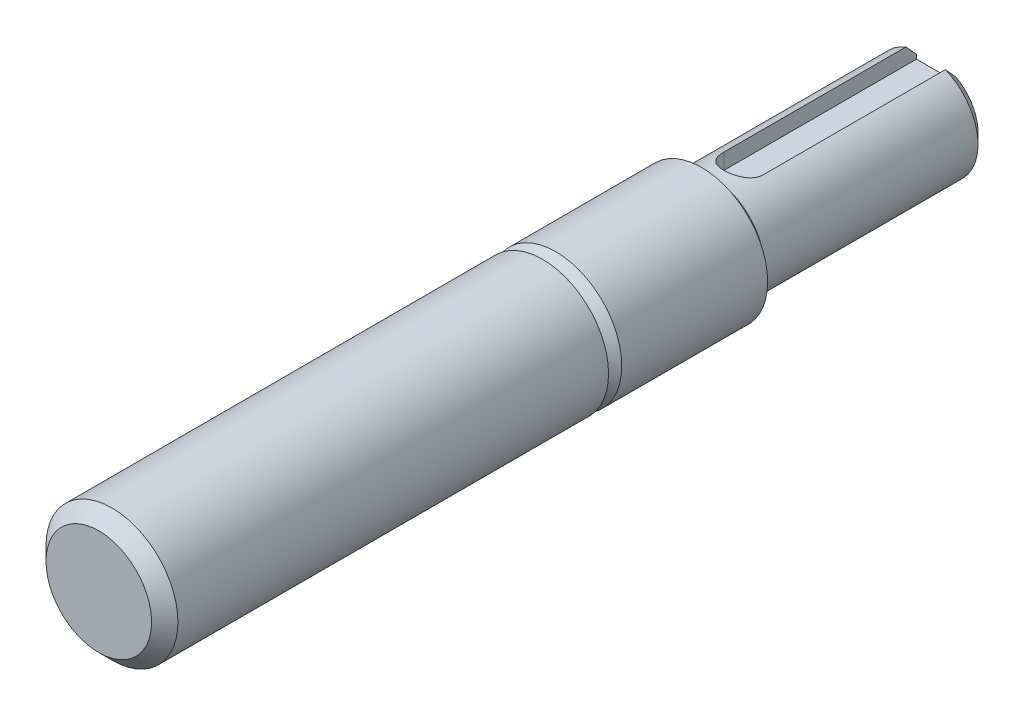
ISO-10303-21;
HEADER;
FILE_DESCRIPTION(('STEP AP214'),'2;1');
FILE_NAME('part.step','',(''),(''),'','','');
FILE_SCHEMA(('AUTOMOTIVE_DESIGN { 1 0 10303 214 1 1 1 1 }'));
ENDSEC;
DATA;
#1=APPLICATION_CONTEXT('core data for automotive mechanical design processes');
#2=APPLICATION_PROTOCOL_DEFINITION('international standard','automotive_design',2000,#1);
#3=PRODUCT_CONTEXT('',#1,'mechanical');
#4=PRODUCT('Part','Part','',(#3));
#5=PRODUCT_RELATED_PRODUCT_CATEGORY('part','',(#4));
#6=PRODUCT_DEFINITION_FORMATION('','',#4);
#7=PRODUCT_DEFINITION_CONTEXT('part definition',#1,'design');
#8=PRODUCT_DEFINITION('design','',#6,#7);
#9=PRODUCT_DEFINITION_SHAPE('','',#8);
#10=(LENGTH_UNIT() NAMED_UNIT(*) SI_UNIT(.MILLI.,.METRE.));
#11=(NAMED_UNIT(*) PLANE_ANGLE_UNIT() SI_UNIT($,.RADIAN.));
#12=(NAMED_UNIT(*) SI_UNIT($,.STERADIAN.) SOLID_ANGLE_UNIT());
#13=UNCERTAINTY_MEASURE_WITH_UNIT(LENGTH_MEASURE(1.E-05),#10,'distance_accuracy_value','');
#14=(GEOMETRIC_REPRESENTATION_CONTEXT(3) GLOBAL_UNCERTAINTY_ASSIGNED_CONTEXT((#13)) GLOBAL_UNIT_ASSIGNED_CONTEXT((#10,
#11,#12)) REPRESENTATION_CONTEXT('',''));
#15=CARTESIAN_POINT('',(0.,0.,0.));
#16=DIRECTION('',(0.,0.,1.));
#17=DIRECTION('',(1.,0.,0.));
#18=AXIS2_PLACEMENT_3D('',#15,#16,#17);
#19=CARTESIAN_POINT('',(0.,1.9812,-39.116));
#20=DIRECTION('',(0.,1.,0.));
#21=DIRECTION('',(0.,0.,1.));
#22=AXIS2_PLACEMENT_3D('',#19,#20,#21);
#23=PLANE('',#22);
#24=CARTESIAN_POINT('',(0.,1.9812,-39.116));
#25=DIRECTION('',(0.,1.,0.));
#26=DIRECTION('',(0.,0.,1.));
#27=AXIS2_PLACEMENT_3D('',#24,#25,#26);
#28=CIRCLE('',#27,1.19380000000001);
#29=CARTESIAN_POINT('',(-1.19380000000001,1.9812,-39.116));
#30=VERTEX_POINT('',#29);
#31=CARTESIAN_POINT('',(1.19380000000001,1.9812,-39.116));
#32=VERTEX_POINT('',#31);
#33=EDGE_CURVE('E74',#30,#32,#28,.T.);
#34=ORIENTED_EDGE('',*,*,#33,.T.);
#35=DIRECTION('',(0.,0.,-1.));
#36=VECTOR('',#35,1.);
#37=CARTESIAN_POINT('',(1.19380000000001,1.9812,-39.116));
#38=LINE('',#37,#36);
#39=CARTESIAN_POINT('',(1.19380000000001,1.9812,-50.8));
#40=VERTEX_POINT('',#39);
#41=EDGE_CURVE('E70',#32,#40,#38,.T.);
#42=ORIENTED_EDGE('',*,*,#41,.T.);
#43=DIRECTION('',(1.,0.,0.));
#44=VECTOR('',#43,1.);
#45=CARTESIAN_POINT('',(0.,1.9812,-50.8));
#46=LINE('',#45,#44);
#47=CARTESIAN_POINT('',(-1.19380000000001,1.9812,-50.8));
#48=VERTEX_POINT('',#47);
#49=EDGE_CURVE('E72',#40,#48,#46,.F.);
#50=ORIENTED_EDGE('',*,*,#49,.T.);
#51=DIRECTION('',(0.,0.,1.));
#52=VECTOR('',#51,1.);
#53=CARTESIAN_POINT('',(-1.19380000000001,1.9812,-50.8));
#54=LINE('',#53,#52);
#55=EDGE_CURVE('E97',#48,#30,#54,.T.);
#56=ORIENTED_EDGE('',*,*,#55,.T.);
#57=EDGE_LOOP('',(#34,#42,#50,#56));
#58=FACE_BOUND('',#57,.T.);
#59=ADVANCED_FACE('F16',(#58),#23,.T.);
#60=CARTESIAN_POINT('',(0.,2.54,-50.8));
#61=DIRECTION('',(0.,0.,1.));
#62=DIRECTION('',(1.,0.,0.));
#63=AXIS2_PLACEMENT_3D('',#60,#61,#62);
#64=PLANE('',#63);
#65=DIRECTION('',(0.,1.,0.));
#66=VECTOR('',#65,1.);
#67=CARTESIAN_POINT('',(1.19380000000001,1.9812,-50.8));
#68=LINE('',#67,#66);
#69=CARTESIAN_POINT('',(1.19380000000001,2.24197269385799,-50.7999999999905));
#70=VERTEX_POINT('',#69);
#71=EDGE_CURVE('E79',#40,#70,#68,.T.);
#72=ORIENTED_EDGE('',*,*,#71,.T.);
#73=CARTESIAN_POINT('',(0.,0.,-50.7999999999811));
#74=DIRECTION('',(0.,0.,1.));
#75=DIRECTION('',(0.,-1.,0.));
#76=AXIS2_PLACEMENT_3D('',#73,#74,#75);
#77=CIRCLE('',#76,2.54000000001042);
#78=CARTESIAN_POINT('',(-1.19380000000001,2.24197269386215,-50.7999999999869));
#79=VERTEX_POINT('',#78);
#80=EDGE_CURVE('E64',#79,#70,#77,.T.);
#81=ORIENTED_EDGE('',*,*,#80,.F.);
#82=DIRECTION('',(0.,1.,0.));
#83=VECTOR('',#82,1.);
#84=CARTESIAN_POINT('',(-1.19380000000001,1.9812,-50.8));
#85=LINE('',#84,#83);
#86=EDGE_CURVE('E85',#79,#48,#85,.F.);
#87=ORIENTED_EDGE('',*,*,#86,.T.);
#88=ORIENTED_EDGE('',*,*,#49,.F.);
#89=EDGE_LOOP('',(#72,#81,#87,#88));
#90=FACE_BOUND('',#89,.T.);
#91=ADVANCED_FACE('F82',(#90),#64,.F.);
#92=CARTESIAN_POINT('',(1.19380000000001,1.9812,-39.116));
#93=DIRECTION('',(1.,0.,0.));
#94=DIRECTION('',(0.,0.,-1.));
#95=AXIS2_PLACEMENT_3D('',#92,#93,#94);
#96=PLANE('',#95);
#97=ORIENTED_EDGE('',*,*,#71,.F.);
#98=ORIENTED_EDGE('',*,*,#41,.F.);
#99=DIRECTION('',(0.,1.,0.));
#100=VECTOR('',#99,1.);
#101=CARTESIAN_POINT('',(1.19380000000001,1.9812,-39.116));
#102=LINE('',#101,#100);
#103=CARTESIAN_POINT('',(1.1938,2.94201743026788,-39.116));
#104=VERTEX_POINT('',#103);
#105=EDGE_CURVE('E91',#32,#104,#102,.T.);
#106=ORIENTED_EDGE('',*,*,#105,.T.);
#107=DIRECTION('',(0.,0.,1.));
#108=VECTOR('',#107,1.);
#109=CARTESIAN_POINT('',(1.19379999999999,2.94201743026788,0.));
#110=LINE('',#109,#108);
#111=CARTESIAN_POINT('',(1.1938,2.94201743026577,-50.1649999999977));
#112=VERTEX_POINT('',#111);
#113=EDGE_CURVE('E130',#112,#104,#110,.T.);
#114=ORIENTED_EDGE('',*,*,#113,.F.);
#115=CARTESIAN_POINT('',(1.19380000000001,2.24197269385559,-50.7999999999927));
#116=CARTESIAN_POINT('',(1.19380000000001,2.30102184773771,-50.7478727474391));
#117=CARTESIAN_POINT('',(1.19380000000001,2.35985132104959,-50.69549787316));
#118=CARTESIAN_POINT('',(1.19380000000001,2.47713422347973,-50.5903327827947));
#119=CARTESIAN_POINT('',(1.19380000000001,2.53558766595209,-50.5375425816077));
#120=CARTESIAN_POINT('',(1.19380000000001,2.65218538347845,-50.4316235937607));
#121=CARTESIAN_POINT('',(1.19380000000001,2.71032966196324,-50.3784948108723));
#122=CARTESIAN_POINT('',(1.19380000000001,2.82635784116005,-50.2719494622469));
#123=CARTESIAN_POINT('',(1.19380000000001,2.88424173252965,-50.2185328863328));
#124=CARTESIAN_POINT('',(1.19380000000001,2.94201743026367,-50.1649999999954));
#125=B_SPLINE_CURVE_WITH_KNOTS('',3,(#115,#116,#117,#118,#119,#120,#121,#122,#123,#124),
.UNSPECIFIED.,.F.,.F.,(4,2,2,2,4),(0.,0.236295571088805,0.472582703695561,0.708867208729262,
0.945160124852192),.UNSPECIFIED.);
#126=EDGE_CURVE('E19',#70,#112,#125,.T.);
#127=ORIENTED_EDGE('',*,*,#126,.F.);
#128=EDGE_LOOP('',(#97,#98,#106,#114,#127));
#129=FACE_BOUND('',#128,.T.);
#130=ADVANCED_FACE('F88',(#129),#96,.F.);
#131=CARTESIAN_POINT('',(0.,1.9812,-39.116));
#132=DIRECTION('',(0.,1.,0.));
#133=DIRECTION('',(0.,0.,1.));
#134=AXIS2_PLACEMENT_3D('',#131,#132,#133);
#135=CYLINDRICAL_SURFACE('',#134,1.19380000000001);
#136=ORIENTED_EDGE('',*,*,#33,.F.);
#137=DIRECTION('',(0.,1.,0.));
#138=VECTOR('',#137,1.);
#139=CARTESIAN_POINT('',(-1.19380000000001,1.9812,-39.116));
#140=LINE('',#139,#138);
#141=CARTESIAN_POINT('',(-1.19380000000001,2.94201743026787,-39.116));
#142=VERTEX_POINT('',#141);
#143=EDGE_CURVE('E39',#30,#142,#140,.T.);
#144=ORIENTED_EDGE('',*,*,#143,.T.);
#145=CARTESIAN_POINT('',(1.19380000000001,2.94201743026787,-39.116));
#146=CARTESIAN_POINT('',(1.19380119866681,2.94201358886016,-39.0837006794339));
#147=CARTESIAN_POINT('',(1.19248832274411,2.94255000472484,-39.0514181860547));
#148=CARTESIAN_POINT('',(1.18726004777156,2.94466476095056,-38.9871097153263));
#149=CARTESIAN_POINT('',(1.18334552701422,2.94624274968451,-38.955083655099));
#150=CARTESIAN_POINT('',(1.16778270495955,2.95246335059753,-38.8599733658816));
#151=CARTESIAN_POINT('',(1.15231460697322,2.95859328345991,-38.7975669873183));
#152=CARTESIAN_POINT('',(1.11178752058578,2.97405718396478,-38.6764915213747));
#153=CARTESIAN_POINT('',(1.08673654710446,2.98338847338763,-38.6178193584763));
#154=CARTESIAN_POINT('',(1.02781996154741,3.00419457553498,-38.5054495950299));
#155=CARTESIAN_POINT('',(0.993947310826063,3.01567109782596,-38.4517560133961));
#156=CARTESIAN_POINT('',(0.916556207241775,3.04010954434601,-38.3482459870198));
#157=CARTESIAN_POINT('',(0.872671556205366,3.05311512160913,-38.2987137068106));
#158=CARTESIAN_POINT('',(0.777268767976151,3.07878482333539,-38.2075022142624));
#159=CARTESIAN_POINT('',(0.725747937264901,3.09144882544369,-38.1658257847587));
#160=CARTESIAN_POINT('',(0.6143515026055,3.11553409970194,-38.0901245060353));
#161=CARTESIAN_POINT('',(0.554248365904535,3.12689715223569,-38.0564145947422));
#162=CARTESIAN_POINT('',(0.428755311996273,3.14655515237975,-37.9997321113863));
#163=CARTESIAN_POINT('',(0.363372090039045,3.15485391337642,-37.9767461843048));
#164=CARTESIAN_POINT('',(0.248113919559845,3.16566292006336,-37.9472046793581));
#165=CARTESIAN_POINT('',(0.199029981495505,3.1691437195283,-37.9378494767225));
#166=CARTESIAN_POINT('',(0.0999697368556447,3.17381293873971,-37.9253464096887));
#167=CARTESIAN_POINT('',(0.0499935098316278,3.175001561824,-37.9221979946888));
#168=CARTESIAN_POINT('',(-0.0645836126415482,3.17499798237338,-37.9222025905412));
#169=CARTESIAN_POINT('',(-0.129196067703951,3.17300972415623,-37.9274627613588));
#170=CARTESIAN_POINT('',(-0.256527554722542,3.16526427616921,-37.9483006085164));
#171=CARTESIAN_POINT('',(-0.319245052887508,3.15950411459594,-37.9638864203256));
#172=CARTESIAN_POINT('',(-0.440872116174805,3.14483739738043,-38.0047409480993));
#173=CARTESIAN_POINT('',(-0.49979020110212,3.135938193104,-38.0299870521123));
#174=CARTESIAN_POINT('',(-0.612540299690452,3.11587921133503,-38.0893476602135));
#175=CARTESIAN_POINT('',(-0.666371662363197,3.10471914507505,-38.1234632973162));
#176=CARTESIAN_POINT('',(-0.769730700845348,3.08075692073994,-38.2011170498578));
#177=CARTESIAN_POINT('',(-0.819012913250933,3.06790808599841,-38.2449673466599));
#178=CARTESIAN_POINT('',(-0.909725244508853,3.04224448099814,-38.3401877476378));
#179=CARTESIAN_POINT('',(-0.951152407159723,3.02942972534667,-38.3915606700694));
#180=CARTESIAN_POINT('',(-1.02655136130083,3.00473884965422,-38.5027816716127));
#181=CARTESIAN_POINT('',(-1.06017236896745,2.99291828643937,-38.5628808896544));
#182=CARTESIAN_POINT('',(-1.11669659174165,2.97229264990151,-38.6883666895999));
#183=CARTESIAN_POINT('',(-1.13961269630879,2.96348395352317,-38.7537468010455));
#184=CARTESIAN_POINT('',(-1.16897915366354,2.95199794769408,-38.8688091509099));
#185=CARTESIAN_POINT('',(-1.17825632196959,2.9482901704303,-38.9176833288506));
#186=CARTESIAN_POINT('',(-1.19067896582103,2.94328394485073,-39.0163579822044));
#187=CARTESIAN_POINT('',(-1.19382013270198,2.9419871895713,-39.0661590837433));
#188=CARTESIAN_POINT('',(-1.19380000000001,2.94201743026787,-39.116));
#189=B_SPLINE_CURVE_WITH_KNOTS('',3,(#145,#146,#147,#148,#149,#150,#151,#152,#153,#154,#155,
#156,#157,#158,#159,#160,#161,#162,#163,#164,#165,#166,#167,#168,#169,#170,#171,#172,#173,#174,
#175,#176,#177,#178,#179,#180,#181,#182,#183,#184,#185,#186,#187,#188),.UNSPECIFIED.,.F.,.F.,(4,
2,2,2,2,2,2,2,2,2,2,2,2,2,2,2,2,2,2,2,2,4),(0.,0.0968341725826232,0.193635671390047,
0.386380325113608,0.57896412240193,0.771702051855779,0.973134503540126,1.17463817656653,
1.383119611818,1.59134071893434,1.74118814916205,1.89102228588731,2.08458400778532,
2.2782984166848,2.47156214275157,2.66485056890994,2.86558014013226,3.06638510544821,
3.27496528909712,3.48329367597682,3.63252530028045,3.7818616765455),.UNSPECIFIED.);
#190=EDGE_CURVE('E121',#104,#142,#189,.T.);
#191=ORIENTED_EDGE('',*,*,#190,.F.);
#192=ORIENTED_EDGE('',*,*,#105,.F.);
#193=EDGE_LOOP('',(#136,#144,#191,#192));
#194=FACE_BOUND('',#193,.T.);
#195=ADVANCED_FACE('F132',(#194),#135,.F.);
#196=CARTESIAN_POINT('',(-1.19380000000001,1.9812,-50.8));
#197=DIRECTION('',(-1.,0.,0.));
#198=DIRECTION('',(0.,0.,1.));
#199=AXIS2_PLACEMENT_3D('',#196,#197,#198);
#200=PLANE('',#199);
#201=ORIENTED_EDGE('',*,*,#55,.F.);
#202=ORIENTED_EDGE('',*,*,#86,.F.);
#203=CARTESIAN_POINT('',(-1.19380000000001,2.94201743026367,-50.1649999999954));
#204=CARTESIAN_POINT('',(-1.19380000000001,2.88424173252965,-50.2185328863328));
#205=CARTESIAN_POINT('',(-1.19380000000001,2.82635784116006,-50.2719494622469));
#206=CARTESIAN_POINT('',(-1.19380000000001,2.71032966196325,-50.3784948108723));
#207=CARTESIAN_POINT('',(-1.19380000000001,2.65218538347846,-50.4316235937607));
#208=CARTESIAN_POINT('',(-1.19380000000001,2.5355876659521,-50.5375425816077));
#209=CARTESIAN_POINT('',(-1.19380000000001,2.47713422347974,-50.5903327827947));
#210=CARTESIAN_POINT('',(-1.19380000000001,2.3598513210496,-50.69549787316));
#211=CARTESIAN_POINT('',(-1.19380000000001,2.30102184773772,-50.7478727474391));
#212=CARTESIAN_POINT('',(-1.19380000000001,2.24197269385561,-50.7999999999927));
#213=B_SPLINE_CURVE_WITH_KNOTS('',3,(#203,#204,#205,#206,#207,#208,#209,#210,#211,#212),
.UNSPECIFIED.,.F.,.F.,(4,2,2,2,4),(0.,0.236292916122926,0.472577421156633,0.708864553763386,
0.945160124852199),.UNSPECIFIED.);
#214=CARTESIAN_POINT('',(-1.19380000000001,2.94201743026577,-50.1649999999977));
#215=VERTEX_POINT('',#214);
#216=EDGE_CURVE('E148',#215,#79,#213,.T.);
#217=ORIENTED_EDGE('',*,*,#216,.F.);
#218=DIRECTION('',(0.,0.,1.));
#219=VECTOR('',#218,1.);
#220=CARTESIAN_POINT('',(-1.19380000000001,2.94201743026787,0.));
#221=LINE('',#220,#219);
#222=EDGE_CURVE('E129',#142,#215,#221,.F.);
#223=ORIENTED_EDGE('',*,*,#222,.F.);
#224=ORIENTED_EDGE('',*,*,#143,.F.);
#225=EDGE_LOOP('',(#201,#202,#217,#223,#224));
#226=FACE_BOUND('',#225,.T.);
#227=ADVANCED_FACE('F145',(#226),#200,.F.);
#228=CARTESIAN_POINT('',(0.,0.,-50.1649999999927));
#229=DIRECTION('',(0.,0.,1.));
#230=DIRECTION('',(0.,-1.,0.));
#231=AXIS2_PLACEMENT_3D('',#228,#229,#230);
#232=CONICAL_SURFACE('',#231,3.17499999999882,0.785398163397448);
#233=ORIENTED_EDGE('',*,*,#80,.T.);
#234=ORIENTED_EDGE('',*,*,#126,.T.);
#235=CARTESIAN_POINT('',(0.,0.,-50.165));
#236=DIRECTION('',(0.,0.,1.));
#237=DIRECTION('',(1.,0.,0.));
#238=AXIS2_PLACEMENT_3D('',#235,#236,#237);
#239=CIRCLE('',#238,3.175);
#240=EDGE_CURVE('E155',#215,#112,#239,.T.);
#241=ORIENTED_EDGE('',*,*,#240,.F.);
#242=ORIENTED_EDGE('',*,*,#216,.T.);
#243=EDGE_LOOP('',(#233,#234,#241,#242));
#244=FACE_BOUND('',#243,.T.);
#245=ADVANCED_FACE('F140',(#244),#232,.T.);
#246=CARTESIAN_POINT('',(0.,0.,0.));
#247=DIRECTION('',(0.,0.,1.));
#248=DIRECTION('',(1.,0.,0.));
#249=AXIS2_PLACEMENT_3D('',#246,#247,#248);
#250=CYLINDRICAL_SURFACE('',#249,3.175);
#251=ORIENTED_EDGE('',*,*,#222,.T.);
#252=ORIENTED_EDGE('',*,*,#240,.T.);
#253=ORIENTED_EDGE('',*,*,#113,.T.);
#254=ORIENTED_EDGE('',*,*,#190,.T.);
#255=EDGE_LOOP('',(#251,#252,#253,#254));
#256=FACE_BOUND('',#255,.T.);
#257=CARTESIAN_POINT('',(0.,0.,-37.2109999999566));
#258=DIRECTION('',(0.,0.,-1.));
#259=DIRECTION('',(-1.,0.,0.));
#260=AXIS2_PLACEMENT_3D('',#257,#258,#259);
#261=CIRCLE('',#260,3.1749999999704);
#262=CARTESIAN_POINT('',(-3.1749999999704,0.,-37.2109999999566));
#263=VERTEX_POINT('',#262);
#264=EDGE_CURVE('E120',#263,#263,#261,.F.);
#265=ORIENTED_EDGE('',*,*,#264,.F.);
#266=EDGE_LOOP('',(#265));
#267=FACE_BOUND('',#266,.T.);
#268=ADVANCED_FACE('F135',(#256,#267),#250,.T.);
#269=CARTESIAN_POINT('',(0.,0.,-37.2109999999566));
#270=DIRECTION('',(0.,0.,-1.));
#271=DIRECTION('',(-1.,0.,0.));
#272=AXIS2_PLACEMENT_3D('',#269,#270,#271);
#273=CONICAL_SURFACE('',#272,3.1749999999704,0.463647609000806);
#274=CARTESIAN_POINT('',(0.,0.,-36.5759999999682));
#275=DIRECTION('',(0.,0.,-1.));
#276=DIRECTION('',(-1.,0.,0.));
#277=AXIS2_PLACEMENT_3D('',#274,#275,#276);
#278=CIRCLE('',#277,2.8574999999762);
#279=CARTESIAN_POINT('',(-2.8574999999762,0.,-36.5759999999682));
#280=VERTEX_POINT('',#279);
#281=EDGE_CURVE('E117',#280,#280,#278,.T.);
#282=ORIENTED_EDGE('',*,*,#281,.T.);
#283=EDGE_LOOP('',(#282));
#284=FACE_BOUND('',#283,.T.);
#285=ORIENTED_EDGE('',*,*,#264,.T.);
#286=EDGE_LOOP('',(#285));
#287=FACE_BOUND('',#286,.T.);
#288=ADVANCED_FACE('F139',(#284,#287),#273,.T.);
#289=CARTESIAN_POINT('',(0.,4.00177,-36.576));
#290=DIRECTION('',(0.,0.,1.));
#291=DIRECTION('',(1.,0.,0.));
#292=AXIS2_PLACEMENT_3D('',#289,#290,#291);
#293=PLANE('',#292);
#294=ORIENTED_EDGE('',*,*,#281,.F.);
#295=EDGE_LOOP('',(#294));
#296=FACE_BOUND('',#295,.T.);
#297=CARTESIAN_POINT('',(0.,0.,-36.576));
#298=DIRECTION('',(0.,0.,1.));
#299=DIRECTION('',(1.,0.,0.));
#300=AXIS2_PLACEMENT_3D('',#297,#298,#299);
#301=CIRCLE('',#300,4.00177);
#302=CARTESIAN_POINT('',(4.00177,0.,-36.576));
#303=VERTEX_POINT('',#302);
#304=EDGE_CURVE('E114',#303,#303,#301,.T.);
#305=ORIENTED_EDGE('',*,*,#304,.F.);
#306=EDGE_LOOP('',(#305));
#307=FACE_BOUND('',#306,.T.);
#308=ADVANCED_FACE('F200',(#296,#307),#293,.F.);
#309=CARTESIAN_POINT('',(0.,0.,0.));
#310=DIRECTION('',(0.,0.,1.));
#311=DIRECTION('',(1.,0.,0.));
#312=AXIS2_PLACEMENT_3D('',#309,#310,#311);
#313=CYLINDRICAL_SURFACE('',#312,4.00177);
#314=ORIENTED_EDGE('',*,*,#304,.T.);
#315=EDGE_LOOP('',(#314));
#316=FACE_BOUND('',#315,.T.);
#317=CARTESIAN_POINT('',(0.,0.,-27.7243539999859));
#318=DIRECTION('',(0.,0.,-1.));
#319=DIRECTION('',(-1.,0.,0.));
#320=AXIS2_PLACEMENT_3D('',#317,#318,#319);
#321=CIRCLE('',#320,4.00176999994528);
#322=CARTESIAN_POINT('',(-4.00176999994528,0.,-27.7243539999859));
#323=VERTEX_POINT('',#322);
#324=EDGE_CURVE('E113',#323,#323,#321,.F.);
#325=ORIENTED_EDGE('',*,*,#324,.F.);
#326=EDGE_LOOP('',(#325));
#327=FACE_BOUND('',#326,.T.);
#328=ADVANCED_FACE('F197',(#316,#327),#313,.T.);
#329=CARTESIAN_POINT('',(0.,0.,-27.7243539999859));
#330=DIRECTION('',(0.,0.,-1.));
#331=DIRECTION('',(0.,1.,0.));
#332=AXIS2_PLACEMENT_3D('',#329,#330,#331);
#333=CONICAL_SURFACE('',#332,4.00176999994528,0.785398163397448);
#334=CARTESIAN_POINT('',(0.,0.,-26.9240000000082));
#335=DIRECTION('',(0.,0.,-1.));
#336=DIRECTION('',(0.,1.,0.));
#337=AXIS2_PLACEMENT_3D('',#334,#335,#336);
#338=CIRCLE('',#337,3.20141599996759);
#339=CARTESIAN_POINT('',(0.,3.20141599996759,-26.9240000000082));
#340=VERTEX_POINT('',#339);
#341=EDGE_CURVE('E110',#340,#340,#338,.T.);
#342=ORIENTED_EDGE('',*,*,#341,.T.);
#343=EDGE_LOOP('',(#342));
#344=FACE_BOUND('',#343,.T.);
#345=ORIENTED_EDGE('',*,*,#324,.T.);
#346=EDGE_LOOP('',(#345));
#347=FACE_BOUND('',#346,.T.);
#348=ADVANCED_FACE('F193',(#344,#347),#333,.T.);
#349=CARTESIAN_POINT('',(0.,0.,0.));
#350=DIRECTION('',(0.,0.,-1.));
#351=DIRECTION('',(-1.,0.,0.));
#352=AXIS2_PLACEMENT_3D('',#349,#350,#351);
#353=PLANE('',#352);
#354=CARTESIAN_POINT('',(0.,0.,0.));
#355=DIRECTION('',(0.,0.,-1.));
#356=DIRECTION('',(-1.,0.,0.));
#357=AXIS2_PLACEMENT_3D('',#354,#355,#356);
#358=CIRCLE('',#357,3.20141599996759);
#359=CARTESIAN_POINT('',(-3.20141599996759,0.,0.));
#360=VERTEX_POINT('',#359);
#361=EDGE_CURVE('E107',#360,#360,#358,.T.);
#362=ORIENTED_EDGE('',*,*,#361,.F.);
#363=EDGE_LOOP('',(#362));
#364=FACE_BOUND('',#363,.T.);
#365=ADVANCED_FACE('F189',(#364),#353,.F.);
#366=CARTESIAN_POINT('',(0.,4.00177,-26.924));
#367=DIRECTION('',(0.,0.,1.));
#368=DIRECTION('',(1.,0.,0.));
#369=AXIS2_PLACEMENT_3D('',#366,#367,#368);
#370=PLANE('',#369);
#371=ORIENTED_EDGE('',*,*,#341,.F.);
#372=EDGE_LOOP('',(#371));
#373=FACE_BOUND('',#372,.T.);
#374=CARTESIAN_POINT('',(0.,0.,-26.924));
#375=DIRECTION('',(0.,0.,1.));
#376=DIRECTION('',(1.,0.,0.));
#377=AXIS2_PLACEMENT_3D('',#374,#375,#376);
#378=CIRCLE('',#377,4.00177);
#379=CARTESIAN_POINT('',(4.00177,0.,-26.924));
#380=VERTEX_POINT('',#379);
#381=EDGE_CURVE('E30',#380,#380,#378,.T.);
#382=ORIENTED_EDGE('',*,*,#381,.F.);
#383=EDGE_LOOP('',(#382));
#384=FACE_BOUND('',#383,.T.);
#385=ADVANCED_FACE('F182',(#373,#384),#370,.F.);
#386=CARTESIAN_POINT('',(0.,0.,-0.800354000034531));
#387=DIRECTION('',(0.,0.,-1.));
#388=DIRECTION('',(-1.,0.,0.));
#389=AXIS2_PLACEMENT_3D('',#386,#387,#388);
#390=CONICAL_SURFACE('',#389,4.00177000000213,0.785398163397448);
#391=CARTESIAN_POINT('',(0.,0.,-0.800354));
#392=DIRECTION('',(0.,0.,1.));
#393=DIRECTION('',(1.,0.,0.));
#394=AXIS2_PLACEMENT_3D('',#391,#392,#393);
#395=CIRCLE('',#394,4.00177);
#396=CARTESIAN_POINT('',(4.00177,0.,-0.800354));
#397=VERTEX_POINT('',#396);
#398=EDGE_CURVE('E11',#397,#397,#395,.F.);
#399=ORIENTED_EDGE('',*,*,#398,.F.);
#400=EDGE_LOOP('',(#399));
#401=FACE_BOUND('',#400,.T.);
#402=ORIENTED_EDGE('',*,*,#361,.T.);
#403=EDGE_LOOP('',(#402));
#404=FACE_BOUND('',#403,.T.);
#405=ADVANCED_FACE('F176',(#401,#404),#390,.T.);
#406=CARTESIAN_POINT('',(0.,0.,0.));
#407=DIRECTION('',(0.,0.,1.));
#408=DIRECTION('',(1.,0.,0.));
#409=AXIS2_PLACEMENT_3D('',#406,#407,#408);
#410=CYLINDRICAL_SURFACE('',#409,4.00177);
#411=ORIENTED_EDGE('',*,*,#398,.T.);
#412=EDGE_LOOP('',(#411));
#413=FACE_BOUND('',#412,.T.);
#414=ORIENTED_EDGE('',*,*,#381,.T.);
#415=EDGE_LOOP('',(#414));
#416=FACE_BOUND('',#415,.T.);
#417=ADVANCED_FACE('F174',(#413,#416),#410,.T.);
#418=CLOSED_SHELL('',(#59,#91,#130,#195,#227,#245,#268,#288,#308,#328,#348,#365,#385,#405,#417));
#419=MANIFOLD_SOLID_BREP('B1',#418);
#420=ADVANCED_BREP_SHAPE_REPRESENTATION('',(#18,#419),#14);
#421=SHAPE_DEFINITION_REPRESENTATION(#9,#420);
ENDSEC;
END-ISO-10303-21;
